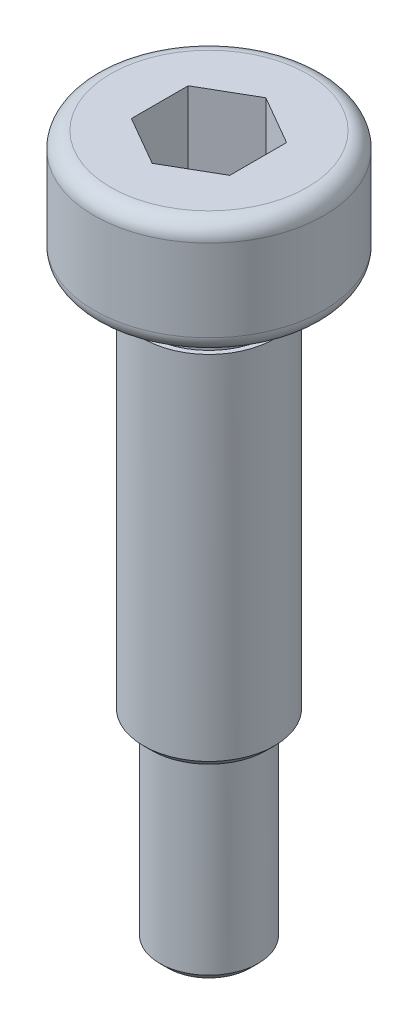
ISO-10303-21;
HEADER;
FILE_DESCRIPTION(('STEP AP214'),'2;1');
FILE_NAME('part.step','',(''),(''),'','','');
FILE_SCHEMA(('AUTOMOTIVE_DESIGN { 1 0 10303 214 1 1 1 1 }'));
ENDSEC;
DATA;
#1=APPLICATION_CONTEXT('core data for automotive mechanical design processes');
#2=APPLICATION_PROTOCOL_DEFINITION('international standard','automotive_design',2000,#1);
#3=PRODUCT_CONTEXT('',#1,'mechanical');
#4=PRODUCT('Part','Part','',(#3));
#5=PRODUCT_RELATED_PRODUCT_CATEGORY('part','',(#4));
#6=PRODUCT_DEFINITION_FORMATION('','',#4);
#7=PRODUCT_DEFINITION_CONTEXT('part definition',#1,'design');
#8=PRODUCT_DEFINITION('design','',#6,#7);
#9=PRODUCT_DEFINITION_SHAPE('','',#8);
#10=(LENGTH_UNIT() NAMED_UNIT(*) SI_UNIT(.MILLI.,.METRE.));
#11=(NAMED_UNIT(*) PLANE_ANGLE_UNIT() SI_UNIT($,.RADIAN.));
#12=(NAMED_UNIT(*) SI_UNIT($,.STERADIAN.) SOLID_ANGLE_UNIT());
#13=UNCERTAINTY_MEASURE_WITH_UNIT(LENGTH_MEASURE(1.E-05),#10,'distance_accuracy_value','');
#14=(GEOMETRIC_REPRESENTATION_CONTEXT(3) GLOBAL_UNCERTAINTY_ASSIGNED_CONTEXT((#13)) GLOBAL_UNIT_ASSIGNED_CONTEXT((#10,
#11,#12)) REPRESENTATION_CONTEXT('',''));
#15=CARTESIAN_POINT('',(0.,0.,0.));
#16=DIRECTION('',(0.,0.,1.));
#17=DIRECTION('',(1.,0.,0.));
#18=AXIS2_PLACEMENT_3D('',#15,#16,#17);
#19=CARTESIAN_POINT('',(0.,3.5,0.));
#20=DIRECTION('',(0.,1.,0.));
#21=DIRECTION('',(-1.,0.,0.));
#22=AXIS2_PLACEMENT_3D('',#19,#20,#21);
#23=CYLINDRICAL_SURFACE('',#22,1.85);
#24=CARTESIAN_POINT('',(0.,-1.,0.));
#25=DIRECTION('',(0.,1.,0.));
#26=DIRECTION('',(-1.,0.,0.));
#27=AXIS2_PLACEMENT_3D('',#24,#25,#26);
#28=CIRCLE('',#27,1.85);
#29=CARTESIAN_POINT('',(-1.85,-1.,0.));
#30=VERTEX_POINT('',#29);
#31=EDGE_CURVE('E118',#30,#30,#28,.T.);
#32=ORIENTED_EDGE('',*,*,#31,.T.);
#33=EDGE_LOOP('',(#32));
#34=FACE_BOUND('',#33,.T.);
#35=CARTESIAN_POINT('',(0.,0.,0.));
#36=DIRECTION('',(0.,1.,0.));
#37=DIRECTION('',(-1.,0.,0.));
#38=AXIS2_PLACEMENT_3D('',#35,#36,#37);
#39=CIRCLE('',#38,1.85);
#40=CARTESIAN_POINT('',(-1.85,0.,0.));
#41=VERTEX_POINT('',#40);
#42=EDGE_CURVE('E132',#41,#41,#39,.T.);
#43=ORIENTED_EDGE('',*,*,#42,.F.);
#44=EDGE_LOOP('',(#43));
#45=FACE_BOUND('',#44,.T.);
#46=ADVANCED_FACE('F15',(#34,#45),#23,.T.);
#47=CARTESIAN_POINT('',(-1.85,0.,0.));
#48=DIRECTION('',(0.,-1.,0.));
#49=DIRECTION('',(1.,0.,0.));
#50=AXIS2_PLACEMENT_3D('',#47,#48,#49);
#51=PLANE('',#50);
#52=CARTESIAN_POINT('',(0.,0.,0.));
#53=DIRECTION('',(0.,-1.,0.));
#54=DIRECTION('',(1.,0.,0.));
#55=AXIS2_PLACEMENT_3D('',#52,#53,#54);
#56=CIRCLE('',#55,3.);
#57=CARTESIAN_POINT('',(3.,0.,0.));
#58=VERTEX_POINT('',#57);
#59=EDGE_CURVE('E141',#58,#58,#56,.T.);
#60=ORIENTED_EDGE('',*,*,#59,.T.);
#61=EDGE_LOOP('',(#60));
#62=FACE_BOUND('',#61,.T.);
#63=ORIENTED_EDGE('',*,*,#42,.T.);
#64=EDGE_LOOP('',(#63));
#65=FACE_BOUND('',#64,.T.);
#66=ADVANCED_FACE('F169',(#62,#65),#51,.T.);
#67=CARTESIAN_POINT('',(0.,3.5,0.));
#68=DIRECTION('',(0.,1.,0.));
#69=DIRECTION('',(-1.,0.,0.));
#70=AXIS2_PLACEMENT_3D('',#67,#68,#69);
#71=CYLINDRICAL_SURFACE('',#70,3.5);
#72=CARTESIAN_POINT('',(0.,0.5,0.));
#73=DIRECTION('',(0.,-1.,0.));
#74=DIRECTION('',(1.,0.,0.));
#75=AXIS2_PLACEMENT_3D('',#72,#73,#74);
#76=CIRCLE('',#75,3.5);
#77=CARTESIAN_POINT('',(3.5,0.5,0.));
#78=VERTEX_POINT('',#77);
#79=EDGE_CURVE('E138',#78,#78,#76,.F.);
#80=ORIENTED_EDGE('',*,*,#79,.T.);
#81=EDGE_LOOP('',(#80));
#82=FACE_BOUND('',#81,.T.);
#83=CARTESIAN_POINT('',(0.,3.,0.));
#84=DIRECTION('',(0.,1.,0.));
#85=DIRECTION('',(-1.,0.,0.));
#86=AXIS2_PLACEMENT_3D('',#83,#84,#85);
#87=CIRCLE('',#86,3.5);
#88=CARTESIAN_POINT('',(-3.5,3.,0.));
#89=VERTEX_POINT('',#88);
#90=EDGE_CURVE('E135',#89,#89,#87,.F.);
#91=ORIENTED_EDGE('',*,*,#90,.T.);
#92=EDGE_LOOP('',(#91));
#93=FACE_BOUND('',#92,.T.);
#94=ADVANCED_FACE('F175',(#82,#93),#71,.T.);
#95=CARTESIAN_POINT('',(-3.5,3.5,0.));
#96=DIRECTION('',(0.,1.,0.));
#97=DIRECTION('',(-1.,0.,0.));
#98=AXIS2_PLACEMENT_3D('',#95,#96,#97);
#99=PLANE('',#98);
#100=CARTESIAN_POINT('',(0.,3.5,0.));
#101=DIRECTION('',(0.,1.,0.));
#102=DIRECTION('',(-1.,0.,0.));
#103=AXIS2_PLACEMENT_3D('',#100,#101,#102);
#104=CIRCLE('',#103,3.);
#105=CARTESIAN_POINT('',(-3.,3.5,0.));
#106=VERTEX_POINT('',#105);
#107=EDGE_CURVE('E144',#106,#106,#104,.T.);
#108=ORIENTED_EDGE('',*,*,#107,.T.);
#109=EDGE_LOOP('',(#108));
#110=FACE_BOUND('',#109,.T.);
#111=DIRECTION('',(-0.866025403784439,0.,-0.5));
#112=VECTOR('',#111,1.);
#113=CARTESIAN_POINT('',(1.5,3.5,-0.866025403784439));
#114=LINE('',#113,#112);
#115=CARTESIAN_POINT('',(1.5,3.5,-0.866025403784439));
#116=VERTEX_POINT('',#115);
#117=CARTESIAN_POINT('',(0.,3.5,-1.73205080756888));
#118=VERTEX_POINT('',#117);
#119=EDGE_CURVE('E31',#116,#118,#114,.T.);
#120=ORIENTED_EDGE('',*,*,#119,.F.);
#121=DIRECTION('',(0.,0.,-1.));
#122=VECTOR('',#121,1.);
#123=CARTESIAN_POINT('',(1.5,3.5,0.86602540378444));
#124=LINE('',#123,#122);
#125=CARTESIAN_POINT('',(1.5,3.5,0.86602540378444));
#126=VERTEX_POINT('',#125);
#127=EDGE_CURVE('E114',#126,#116,#124,.T.);
#128=ORIENTED_EDGE('',*,*,#127,.F.);
#129=DIRECTION('',(0.866025403784439,0.,-0.5));
#130=VECTOR('',#129,1.);
#131=CARTESIAN_POINT('',(0.,3.5,1.73205080756888));
#132=LINE('',#131,#130);
#133=CARTESIAN_POINT('',(0.,3.5,1.73205080756888));
#134=VERTEX_POINT('',#133);
#135=EDGE_CURVE('E112',#134,#126,#132,.T.);
#136=ORIENTED_EDGE('',*,*,#135,.F.);
#137=DIRECTION('',(0.866025403784439,0.,0.5));
#138=VECTOR('',#137,1.);
#139=CARTESIAN_POINT('',(-1.5,3.5,0.86602540378444));
#140=LINE('',#139,#138);
#141=CARTESIAN_POINT('',(-1.5,3.5,0.86602540378444));
#142=VERTEX_POINT('',#141);
#143=EDGE_CURVE('E79',#142,#134,#140,.T.);
#144=ORIENTED_EDGE('',*,*,#143,.F.);
#145=DIRECTION('',(0.,0.,1.));
#146=VECTOR('',#145,1.);
#147=CARTESIAN_POINT('',(-1.5,3.5,-0.866025403784439));
#148=LINE('',#147,#146);
#149=CARTESIAN_POINT('',(-1.5,3.5,-0.866025403784439));
#150=VERTEX_POINT('',#149);
#151=EDGE_CURVE('E108',#150,#142,#148,.T.);
#152=ORIENTED_EDGE('',*,*,#151,.F.);
#153=DIRECTION('',(-0.866025403784439,0.,0.5));
#154=VECTOR('',#153,1.);
#155=CARTESIAN_POINT('',(0.,3.5,-1.73205080756887));
#156=LINE('',#155,#154);
#157=EDGE_CURVE('E105',#118,#150,#156,.T.);
#158=ORIENTED_EDGE('',*,*,#157,.F.);
#159=EDGE_LOOP('',(#120,#128,#136,#144,#152,#158));
#160=FACE_BOUND('',#159,.T.);
#161=ADVANCED_FACE('F201',(#110,#160),#99,.T.);
#162=CARTESIAN_POINT('',(-1.5,-18.,0.));
#163=DIRECTION('',(0.,-1.,0.));
#164=DIRECTION('',(1.,0.,0.));
#165=AXIS2_PLACEMENT_3D('',#162,#163,#164);
#166=PLANE('',#165);
#167=CARTESIAN_POINT('',(0.,-18.,0.));
#168=DIRECTION('',(0.,-1.,0.));
#169=DIRECTION('',(1.,0.,0.));
#170=AXIS2_PLACEMENT_3D('',#167,#168,#169);
#171=CIRCLE('',#170,1.25);
#172=CARTESIAN_POINT('',(1.25,-18.,0.));
#173=VERTEX_POINT('',#172);
#174=EDGE_CURVE('E150',#173,#173,#171,.T.);
#175=ORIENTED_EDGE('',*,*,#174,.T.);
#176=EDGE_LOOP('',(#175));
#177=FACE_BOUND('',#176,.T.);
#178=ADVANCED_FACE('F204',(#177),#166,.T.);
#179=CARTESIAN_POINT('',(0.,3.5,0.));
#180=DIRECTION('',(0.,1.,0.));
#181=DIRECTION('',(-1.,0.,0.));
#182=AXIS2_PLACEMENT_3D('',#179,#180,#181);
#183=CYLINDRICAL_SURFACE('',#182,1.5);
#184=CARTESIAN_POINT('',(0.,-17.75,0.));
#185=DIRECTION('',(0.,-1.,0.));
#186=DIRECTION('',(1.,0.,0.));
#187=AXIS2_PLACEMENT_3D('',#184,#185,#186);
#188=CIRCLE('',#187,1.5);
#189=CARTESIAN_POINT('',(1.5,-17.75,0.));
#190=VERTEX_POINT('',#189);
#191=EDGE_CURVE('E147',#190,#190,#188,.F.);
#192=ORIENTED_EDGE('',*,*,#191,.T.);
#193=EDGE_LOOP('',(#192));
#194=FACE_BOUND('',#193,.T.);
#195=CARTESIAN_POINT('',(0.,-12.,0.));
#196=DIRECTION('',(0.,1.,0.));
#197=DIRECTION('',(-1.,0.,0.));
#198=AXIS2_PLACEMENT_3D('',#195,#196,#197);
#199=CIRCLE('',#198,1.5);
#200=CARTESIAN_POINT('',(-1.5,-12.,0.));
#201=VERTEX_POINT('',#200);
#202=EDGE_CURVE('E129',#201,#201,#199,.T.);
#203=ORIENTED_EDGE('',*,*,#202,.F.);
#204=EDGE_LOOP('',(#203));
#205=FACE_BOUND('',#204,.T.);
#206=ADVANCED_FACE('F232',(#194,#205),#183,.T.);
#207=CARTESIAN_POINT('',(-2.,-12.,0.));
#208=DIRECTION('',(0.,-1.,0.));
#209=DIRECTION('',(1.,0.,0.));
#210=AXIS2_PLACEMENT_3D('',#207,#208,#209);
#211=PLANE('',#210);
#212=CARTESIAN_POINT('',(0.,-12.,0.));
#213=DIRECTION('',(0.,-1.,0.));
#214=DIRECTION('',(1.,0.,0.));
#215=AXIS2_PLACEMENT_3D('',#212,#213,#214);
#216=CIRCLE('',#215,1.75);
#217=CARTESIAN_POINT('',(1.75,-12.,0.));
#218=VERTEX_POINT('',#217);
#219=EDGE_CURVE('E10',#218,#218,#216,.T.);
#220=ORIENTED_EDGE('',*,*,#219,.T.);
#221=EDGE_LOOP('',(#220));
#222=FACE_BOUND('',#221,.T.);
#223=ORIENTED_EDGE('',*,*,#202,.T.);
#224=EDGE_LOOP('',(#223));
#225=FACE_BOUND('',#224,.T.);
#226=ADVANCED_FACE('F229',(#222,#225),#211,.T.);
#227=CARTESIAN_POINT('',(0.,3.5,0.));
#228=DIRECTION('',(0.,1.,0.));
#229=DIRECTION('',(-1.,0.,0.));
#230=AXIS2_PLACEMENT_3D('',#227,#228,#229);
#231=CYLINDRICAL_SURFACE('',#230,2.);
#232=CARTESIAN_POINT('',(0.,-11.75,0.));
#233=DIRECTION('',(0.,-1.,0.));
#234=DIRECTION('',(1.,0.,0.));
#235=AXIS2_PLACEMENT_3D('',#232,#233,#234);
#236=CIRCLE('',#235,2.);
#237=CARTESIAN_POINT('',(2.,-11.75,0.));
#238=VERTEX_POINT('',#237);
#239=EDGE_CURVE('E24',#238,#238,#236,.F.);
#240=ORIENTED_EDGE('',*,*,#239,.T.);
#241=EDGE_LOOP('',(#240));
#242=FACE_BOUND('',#241,.T.);
#243=CARTESIAN_POINT('',(0.,-1.,0.));
#244=DIRECTION('',(0.,1.,0.));
#245=DIRECTION('',(-1.,0.,0.));
#246=AXIS2_PLACEMENT_3D('',#243,#244,#245);
#247=CIRCLE('',#246,2.);
#248=CARTESIAN_POINT('',(-2.,-1.,0.));
#249=VERTEX_POINT('',#248);
#250=EDGE_CURVE('E126',#249,#249,#247,.T.);
#251=ORIENTED_EDGE('',*,*,#250,.F.);
#252=EDGE_LOOP('',(#251));
#253=FACE_BOUND('',#252,.T.);
#254=ADVANCED_FACE('F155',(#242,#253),#231,.T.);
#255=CARTESIAN_POINT('',(-1.85,-1.,0.));
#256=DIRECTION('',(0.,1.,0.));
#257=DIRECTION('',(-1.,0.,0.));
#258=AXIS2_PLACEMENT_3D('',#255,#256,#257);
#259=PLANE('',#258);
#260=ORIENTED_EDGE('',*,*,#250,.T.);
#261=EDGE_LOOP('',(#260));
#262=FACE_BOUND('',#261,.T.);
#263=ORIENTED_EDGE('',*,*,#31,.F.);
#264=EDGE_LOOP('',(#263));
#265=FACE_BOUND('',#264,.T.);
#266=ADVANCED_FACE('F215',(#262,#265),#259,.T.);
#267=CARTESIAN_POINT('',(1.5,1.1,-0.866025403784439));
#268=DIRECTION('',(0.5,0.,-0.866025403784439));
#269=DIRECTION('',(-0.866025403784439,0.,-0.5));
#270=AXIS2_PLACEMENT_3D('',#267,#268,#269);
#271=PLANE('',#270);
#272=ORIENTED_EDGE('',*,*,#119,.T.);
#273=DIRECTION('',(0.,1.,0.));
#274=VECTOR('',#273,1.);
#275=CARTESIAN_POINT('',(0.,1.1,-1.73205080756887));
#276=LINE('',#275,#274);
#277=CARTESIAN_POINT('',(0.,1.1,-1.73205080756887));
#278=VERTEX_POINT('',#277);
#279=EDGE_CURVE('E61',#278,#118,#276,.T.);
#280=ORIENTED_EDGE('',*,*,#279,.F.);
#281=DIRECTION('',(-0.866025403784439,0.,-0.5));
#282=VECTOR('',#281,1.);
#283=CARTESIAN_POINT('',(1.5,1.1,-0.866025403784439));
#284=LINE('',#283,#282);
#285=CARTESIAN_POINT('',(1.5,1.1,-0.866025403784439));
#286=VERTEX_POINT('',#285);
#287=EDGE_CURVE('E116',#286,#278,#284,.T.);
#288=ORIENTED_EDGE('',*,*,#287,.F.);
#289=DIRECTION('',(0.,1.,0.));
#290=VECTOR('',#289,1.);
#291=CARTESIAN_POINT('',(1.5,1.1,-0.866025403784439));
#292=LINE('',#291,#290);
#293=EDGE_CURVE('E39',#286,#116,#292,.T.);
#294=ORIENTED_EDGE('',*,*,#293,.T.);
#295=EDGE_LOOP('',(#272,#280,#288,#294));
#296=FACE_BOUND('',#295,.T.);
#297=ADVANCED_FACE('F212',(#296),#271,.F.);
#298=CARTESIAN_POINT('',(1.5,1.1,0.86602540378444));
#299=DIRECTION('',(1.,0.,0.));
#300=DIRECTION('',(0.,1.,0.));
#301=AXIS2_PLACEMENT_3D('',#298,#299,#300);
#302=PLANE('',#301);
#303=ORIENTED_EDGE('',*,*,#127,.T.);
#304=ORIENTED_EDGE('',*,*,#293,.F.);
#305=DIRECTION('',(0.,0.,-1.));
#306=VECTOR('',#305,1.);
#307=CARTESIAN_POINT('',(1.5,1.1,0.86602540378444));
#308=LINE('',#307,#306);
#309=CARTESIAN_POINT('',(1.5,1.1,0.86602540378444));
#310=VERTEX_POINT('',#309);
#311=EDGE_CURVE('E91',#310,#286,#308,.T.);
#312=ORIENTED_EDGE('',*,*,#311,.F.);
#313=DIRECTION('',(0.,1.,0.));
#314=VECTOR('',#313,1.);
#315=CARTESIAN_POINT('',(1.5,1.1,0.86602540378444));
#316=LINE('',#315,#314);
#317=EDGE_CURVE('E83',#310,#126,#316,.T.);
#318=ORIENTED_EDGE('',*,*,#317,.T.);
#319=EDGE_LOOP('',(#303,#304,#312,#318));
#320=FACE_BOUND('',#319,.T.);
#321=ADVANCED_FACE('F214',(#320),#302,.F.);
#322=CARTESIAN_POINT('',(0.,1.1,1.73205080756888));
#323=DIRECTION('',(0.5,0.,0.866025403784439));
#324=DIRECTION('',(0.866025403784439,0.,-0.5));
#325=AXIS2_PLACEMENT_3D('',#322,#323,#324);
#326=PLANE('',#325);
#327=ORIENTED_EDGE('',*,*,#135,.T.);
#328=ORIENTED_EDGE('',*,*,#317,.F.);
#329=DIRECTION('',(0.866025403784439,0.,-0.5));
#330=VECTOR('',#329,1.);
#331=CARTESIAN_POINT('',(0.,1.1,1.73205080756888));
#332=LINE('',#331,#330);
#333=CARTESIAN_POINT('',(0.,1.1,1.73205080756888));
#334=VERTEX_POINT('',#333);
#335=EDGE_CURVE('E87',#334,#310,#332,.T.);
#336=ORIENTED_EDGE('',*,*,#335,.F.);
#337=DIRECTION('',(0.,1.,0.));
#338=VECTOR('',#337,1.);
#339=CARTESIAN_POINT('',(0.,1.1,1.73205080756888));
#340=LINE('',#339,#338);
#341=EDGE_CURVE('E72',#334,#134,#340,.T.);
#342=ORIENTED_EDGE('',*,*,#341,.T.);
#343=EDGE_LOOP('',(#327,#328,#336,#342));
#344=FACE_BOUND('',#343,.T.);
#345=ADVANCED_FACE('F88',(#344),#326,.F.);
#346=CARTESIAN_POINT('',(-1.5,1.1,0.86602540378444));
#347=DIRECTION('',(-0.5,0.,0.866025403784439));
#348=DIRECTION('',(0.866025403784439,0.,0.5));
#349=AXIS2_PLACEMENT_3D('',#346,#347,#348);
#350=PLANE('',#349);
#351=ORIENTED_EDGE('',*,*,#143,.T.);
#352=ORIENTED_EDGE('',*,*,#341,.F.);
#353=DIRECTION('',(0.866025403784439,0.,0.5));
#354=VECTOR('',#353,1.);
#355=CARTESIAN_POINT('',(-1.5,1.1,0.86602540378444));
#356=LINE('',#355,#354);
#357=CARTESIAN_POINT('',(-1.5,1.1,0.86602540378444));
#358=VERTEX_POINT('',#357);
#359=EDGE_CURVE('E76',#358,#334,#356,.T.);
#360=ORIENTED_EDGE('',*,*,#359,.F.);
#361=DIRECTION('',(0.,1.,0.));
#362=VECTOR('',#361,1.);
#363=CARTESIAN_POINT('',(-1.5,1.1,0.86602540378444));
#364=LINE('',#363,#362);
#365=EDGE_CURVE('E84',#358,#142,#364,.T.);
#366=ORIENTED_EDGE('',*,*,#365,.T.);
#367=EDGE_LOOP('',(#351,#352,#360,#366));
#368=FACE_BOUND('',#367,.T.);
#369=ADVANCED_FACE('F74',(#368),#350,.F.);
#370=CARTESIAN_POINT('',(-1.5,1.1,-0.866025403784439));
#371=DIRECTION('',(-1.,0.,0.));
#372=DIRECTION('',(0.,-1.,0.));
#373=AXIS2_PLACEMENT_3D('',#370,#371,#372);
#374=PLANE('',#373);
#375=ORIENTED_EDGE('',*,*,#151,.T.);
#376=ORIENTED_EDGE('',*,*,#365,.F.);
#377=DIRECTION('',(0.,0.,1.));
#378=VECTOR('',#377,1.);
#379=CARTESIAN_POINT('',(-1.5,1.1,-0.866025403784439));
#380=LINE('',#379,#378);
#381=CARTESIAN_POINT('',(-1.5,1.1,-0.866025403784439));
#382=VERTEX_POINT('',#381);
#383=EDGE_CURVE('E97',#382,#358,#380,.T.);
#384=ORIENTED_EDGE('',*,*,#383,.F.);
#385=DIRECTION('',(0.,1.,0.));
#386=VECTOR('',#385,1.);
#387=CARTESIAN_POINT('',(-1.5,1.1,-0.866025403784439));
#388=LINE('',#387,#386);
#389=EDGE_CURVE('E121',#382,#150,#388,.T.);
#390=ORIENTED_EDGE('',*,*,#389,.T.);
#391=EDGE_LOOP('',(#375,#376,#384,#390));
#392=FACE_BOUND('',#391,.T.);
#393=ADVANCED_FACE('F311',(#392),#374,.F.);
#394=CARTESIAN_POINT('',(0.,1.1,-1.73205080756887));
#395=DIRECTION('',(-0.5,0.,-0.866025403784439));
#396=DIRECTION('',(-0.866025403784439,0.,0.5));
#397=AXIS2_PLACEMENT_3D('',#394,#395,#396);
#398=PLANE('',#397);
#399=ORIENTED_EDGE('',*,*,#157,.T.);
#400=ORIENTED_EDGE('',*,*,#389,.F.);
#401=DIRECTION('',(-0.866025403784439,0.,0.5));
#402=VECTOR('',#401,1.);
#403=CARTESIAN_POINT('',(0.,1.1,-1.73205080756887));
#404=LINE('',#403,#402);
#405=EDGE_CURVE('E99',#278,#382,#404,.T.);
#406=ORIENTED_EDGE('',*,*,#405,.F.);
#407=ORIENTED_EDGE('',*,*,#279,.T.);
#408=EDGE_LOOP('',(#399,#400,#406,#407));
#409=FACE_BOUND('',#408,.T.);
#410=ADVANCED_FACE('F210',(#409),#398,.F.);
#411=CARTESIAN_POINT('',(0.,1.1,0.));
#412=DIRECTION('',(0.,1.,0.));
#413=DIRECTION('',(0.,0.,1.));
#414=AXIS2_PLACEMENT_3D('',#411,#412,#413);
#415=PLANE('',#414);
#416=ORIENTED_EDGE('',*,*,#287,.T.);
#417=ORIENTED_EDGE('',*,*,#405,.T.);
#418=ORIENTED_EDGE('',*,*,#383,.T.);
#419=ORIENTED_EDGE('',*,*,#359,.T.);
#420=ORIENTED_EDGE('',*,*,#335,.T.);
#421=ORIENTED_EDGE('',*,*,#311,.T.);
#422=EDGE_LOOP('',(#416,#417,#418,#419,#420,#421));
#423=FACE_BOUND('',#422,.T.);
#424=ADVANCED_FACE('F94',(#423),#415,.T.);
#425=CARTESIAN_POINT('',(0.,0.5,0.));
#426=DIRECTION('',(0.,-1.,0.));
#427=DIRECTION('',(1.,0.,0.));
#428=AXIS2_PLACEMENT_3D('',#425,#426,#427);
#429=TOROIDAL_SURFACE('',#428,3.,0.5);
#430=ORIENTED_EDGE('',*,*,#59,.F.);
#431=EDGE_LOOP('',(#430));
#432=FACE_BOUND('',#431,.T.);
#433=ORIENTED_EDGE('',*,*,#79,.F.);
#434=EDGE_LOOP('',(#433));
#435=FACE_BOUND('',#434,.T.);
#436=ADVANCED_FACE('F181',(#432,#435),#429,.T.);
#437=CARTESIAN_POINT('',(0.,3.,0.));
#438=DIRECTION('',(0.,1.,0.));
#439=DIRECTION('',(-1.,0.,0.));
#440=AXIS2_PLACEMENT_3D('',#437,#438,#439);
#441=TOROIDAL_SURFACE('',#440,3.,0.5);
#442=ORIENTED_EDGE('',*,*,#90,.F.);
#443=EDGE_LOOP('',(#442));
#444=FACE_BOUND('',#443,.T.);
#445=ORIENTED_EDGE('',*,*,#107,.F.);
#446=EDGE_LOOP('',(#445));
#447=FACE_BOUND('',#446,.T.);
#448=ADVANCED_FACE('F165',(#444,#447),#441,.T.);
#449=CARTESIAN_POINT('',(0.,-17.75,0.));
#450=DIRECTION('',(0.,1.,0.));
#451=DIRECTION('',(-1.,0.,0.));
#452=AXIS2_PLACEMENT_3D('',#449,#450,#451);
#453=CONICAL_SURFACE('',#452,1.5,0.785398163397441);
#454=ORIENTED_EDGE('',*,*,#174,.F.);
#455=EDGE_LOOP('',(#454));
#456=FACE_BOUND('',#455,.T.);
#457=ORIENTED_EDGE('',*,*,#191,.F.);
#458=EDGE_LOOP('',(#457));
#459=FACE_BOUND('',#458,.T.);
#460=ADVANCED_FACE('F159',(#456,#459),#453,.T.);
#461=CARTESIAN_POINT('',(0.,-11.75,0.));
#462=DIRECTION('',(0.,1.,0.));
#463=DIRECTION('',(-1.,0.,0.));
#464=AXIS2_PLACEMENT_3D('',#461,#462,#463);
#465=CONICAL_SURFACE('',#464,2.,0.78539816339745);
#466=ORIENTED_EDGE('',*,*,#219,.F.);
#467=EDGE_LOOP('',(#466));
#468=FACE_BOUND('',#467,.T.);
#469=ORIENTED_EDGE('',*,*,#239,.F.);
#470=EDGE_LOOP('',(#469));
#471=FACE_BOUND('',#470,.T.);
#472=ADVANCED_FACE('F18',(#468,#471),#465,.T.);
#473=CLOSED_SHELL('',(#46,#66,#94,#161,#178,#206,#226,#254,#266,#297,#321,#345,#369,#393,#410,
#424,#436,#448,#460,#472));
#474=MANIFOLD_SOLID_BREP('B1',#473);
#475=ADVANCED_BREP_SHAPE_REPRESENTATION('',(#18,#474),#14);
#476=SHAPE_DEFINITION_REPRESENTATION(#9,#475);
ENDSEC;
END-ISO-10303-21;
